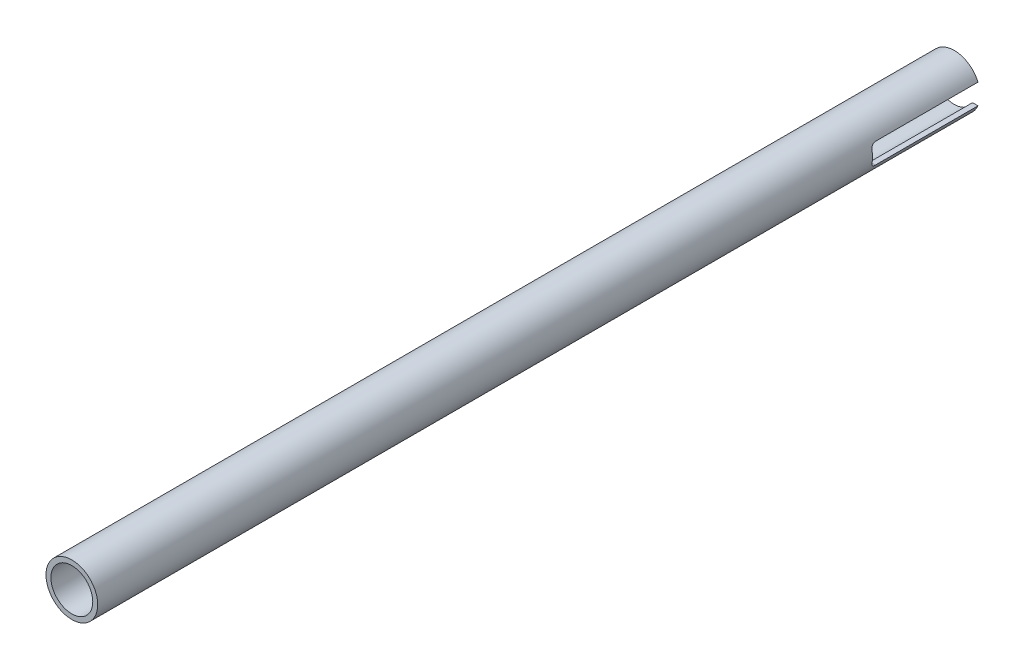
ISO-10303-21;
HEADER;
FILE_DESCRIPTION(('STEP AP214'),'2;1');
FILE_NAME('part.step','',(''),(''),'','','');
FILE_SCHEMA(('AUTOMOTIVE_DESIGN { 1 0 10303 214 1 1 1 1 }'));
ENDSEC;
DATA;
#1=APPLICATION_CONTEXT('core data for automotive mechanical design processes');
#2=APPLICATION_PROTOCOL_DEFINITION('international standard','automotive_design',2000,#1);
#3=PRODUCT_CONTEXT('',#1,'mechanical');
#4=PRODUCT('Part','Part','',(#3));
#5=PRODUCT_RELATED_PRODUCT_CATEGORY('part','',(#4));
#6=PRODUCT_DEFINITION_FORMATION('','',#4);
#7=PRODUCT_DEFINITION_CONTEXT('part definition',#1,'design');
#8=PRODUCT_DEFINITION('design','',#6,#7);
#9=PRODUCT_DEFINITION_SHAPE('','',#8);
#10=(LENGTH_UNIT() NAMED_UNIT(*) SI_UNIT(.MILLI.,.METRE.));
#11=(NAMED_UNIT(*) PLANE_ANGLE_UNIT() SI_UNIT($,.RADIAN.));
#12=(NAMED_UNIT(*) SI_UNIT($,.STERADIAN.) SOLID_ANGLE_UNIT());
#13=UNCERTAINTY_MEASURE_WITH_UNIT(LENGTH_MEASURE(1.E-05),#10,'distance_accuracy_value','');
#14=(GEOMETRIC_REPRESENTATION_CONTEXT(3) GLOBAL_UNCERTAINTY_ASSIGNED_CONTEXT((#13)) GLOBAL_UNIT_ASSIGNED_CONTEXT((#10,
#11,#12)) REPRESENTATION_CONTEXT('',''));
#15=CARTESIAN_POINT('',(0.,0.,0.));
#16=DIRECTION('',(0.,0.,1.));
#17=DIRECTION('',(1.,0.,0.));
#18=AXIS2_PLACEMENT_3D('',#15,#16,#17);
#19=CARTESIAN_POINT('',(0.,0.,0.));
#20=DIRECTION('',(0.,0.,1.));
#21=DIRECTION('',(1.,0.,0.));
#22=AXIS2_PLACEMENT_3D('',#19,#20,#21);
#23=PLANE('',#22);
#24=DIRECTION('',(-1.,0.,0.));
#25=VECTOR('',#24,1.);
#26=CARTESIAN_POINT('',(352.483983387758,-3.17500000000001,0.));
#27=LINE('',#26,#25);
#28=CARTESIAN_POINT('',(7.34407080575888,-3.17500000000001,0.));
#29=VERTEX_POINT('',#28);
#30=CARTESIAN_POINT('',(5.64543213580679,-3.17499999999999,0.));
#31=VERTEX_POINT('',#30);
#32=EDGE_CURVE('E66',#29,#31,#27,.T.);
#33=ORIENTED_EDGE('',*,*,#32,.F.);
#34=CARTESIAN_POINT('',(0.,0.,0.));
#35=DIRECTION('',(0.,0.,1.));
#36=DIRECTION('',(1.,0.,0.));
#37=AXIS2_PLACEMENT_3D('',#34,#35,#36);
#38=CIRCLE('',#37,8.001);
#39=CARTESIAN_POINT('',(-7.34407080575888,-3.17500000000001,0.));
#40=VERTEX_POINT('',#39);
#41=EDGE_CURVE('E157',#40,#29,#38,.T.);
#42=ORIENTED_EDGE('',*,*,#41,.F.);
#43=CARTESIAN_POINT('',(-5.64543213580682,-3.17500000000001,0.));
#44=VERTEX_POINT('',#43);
#45=EDGE_CURVE('E151',#44,#40,#27,.T.);
#46=ORIENTED_EDGE('',*,*,#45,.F.);
#47=CARTESIAN_POINT('',(0.,0.,0.));
#48=DIRECTION('',(0.,0.,1.));
#49=DIRECTION('',(1.,0.,0.));
#50=AXIS2_PLACEMENT_3D('',#47,#48,#49);
#51=CIRCLE('',#50,6.477);
#52=EDGE_CURVE('E262',#44,#31,#51,.T.);
#53=ORIENTED_EDGE('',*,*,#52,.T.);
#54=EDGE_LOOP('',(#33,#42,#46,#53));
#55=FACE_BOUND('',#54,.T.);
#56=ADVANCED_FACE('F41',(#55),#23,.F.);
#57=CARTESIAN_POINT('',(0.,0.,273.05));
#58=DIRECTION('',(0.,0.,-1.));
#59=DIRECTION('',(-1.,0.,0.));
#60=AXIS2_PLACEMENT_3D('',#57,#58,#59);
#61=CYLINDRICAL_SURFACE('',#60,8.001);
#62=CARTESIAN_POINT('',(0.,0.,273.05));
#63=DIRECTION('',(0.,0.,1.));
#64=DIRECTION('',(1.,0.,0.));
#65=AXIS2_PLACEMENT_3D('',#62,#63,#64);
#66=CIRCLE('',#65,8.001);
#67=CARTESIAN_POINT('',(8.001,0.,273.05));
#68=VERTEX_POINT('',#67);
#69=EDGE_CURVE('E271',#68,#68,#66,.T.);
#70=ORIENTED_EDGE('',*,*,#69,.F.);
#71=EDGE_LOOP('',(#70));
#72=FACE_BOUND('',#71,.T.);
#73=DIRECTION('',(0.,0.,-1.));
#74=VECTOR('',#73,1.);
#75=CARTESIAN_POINT('',(7.34407080575892,3.17499999999992,273.05));
#76=LINE('',#75,#74);
#77=CARTESIAN_POINT('',(7.34407080575894,3.175,0.));
#78=VERTEX_POINT('',#77);
#79=CARTESIAN_POINT('',(7.34407080575889,3.17499999999999,31.75));
#80=VERTEX_POINT('',#79);
#81=EDGE_CURVE('E256',#78,#80,#76,.F.);
#82=ORIENTED_EDGE('',*,*,#81,.F.);
#83=CARTESIAN_POINT('',(-7.34407080575894,3.175,0.));
#84=VERTEX_POINT('',#83);
#85=EDGE_CURVE('E276',#78,#84,#38,.T.);
#86=ORIENTED_EDGE('',*,*,#85,.T.);
#87=DIRECTION('',(0.,0.,-1.));
#88=VECTOR('',#87,1.);
#89=CARTESIAN_POINT('',(-7.34407080575892,3.17499999999992,273.05));
#90=LINE('',#89,#88);
#91=CARTESIAN_POINT('',(-7.34407080575889,3.17499999999999,31.75));
#92=VERTEX_POINT('',#91);
#93=EDGE_CURVE('E259',#92,#84,#90,.T.);
#94=ORIENTED_EDGE('',*,*,#93,.F.);
#95=CARTESIAN_POINT('',(-7.8288057837706,1.65099999999999,33.274));
#96=CARTESIAN_POINT('',(-7.81947795268345,1.69524181564514,33.2739996807889));
#97=CARTESIAN_POINT('',(-7.80977555287386,1.73937906238703,33.2720725755956));
#98=CARTESIAN_POINT('',(-7.7897053190962,1.82715995012294,33.2644259194222));
#99=CARTESIAN_POINT('',(-7.77933765259943,1.870803712116,33.2587073195399));
#100=CARTESIAN_POINT('',(-7.74740781787862,2.00038689143379,33.2359920832168));
#101=CARTESIAN_POINT('',(-7.72497172734663,2.08520038066885,33.2134353611242));
#102=CARTESIAN_POINT('',(-7.67879255624773,2.24931803273243,33.1543529357356));
#103=CARTESIAN_POINT('',(-7.65505009243317,2.32862475603218,33.117833776622));
#104=CARTESIAN_POINT('',(-7.60739952527334,2.47987144136614,33.0318403935313));
#105=CARTESIAN_POINT('',(-7.58349136309819,2.55180862700726,32.9823613118312));
#106=CARTESIAN_POINT('',(-7.53640113822511,2.68773877112478,32.8705553900397));
#107=CARTESIAN_POINT('',(-7.51324222932276,2.75155008701076,32.8079974672164));
#108=CARTESIAN_POINT('',(-7.46969556535498,2.86766507697724,32.6721080561482));
#109=CARTESIAN_POINT('',(-7.44930787514765,2.91996848174228,32.5987763158346));
#110=CARTESIAN_POINT('',(-7.41339882631975,3.00995182097469,32.445356056821));
#111=CARTESIAN_POINT('',(-7.39775949227146,3.04799299625043,32.365507568052));
#112=CARTESIAN_POINT('',(-7.37198636942666,3.10981595853761,32.1996963126839));
#113=CARTESIAN_POINT('',(-7.36184321814924,3.13362200161646,32.1137442276388));
#114=CARTESIAN_POINT('',(-7.35134082404798,3.15814271182933,31.980748149592));
#115=CARTESIAN_POINT('',(-7.34862226710174,3.16445643648463,31.9348527548858));
#116=CARTESIAN_POINT('',(-7.34498545577234,3.17288497032065,31.8426477775769));
#117=CARTESIAN_POINT('',(-7.34406565426136,3.17500338794749,31.7963385853611));
#118=CARTESIAN_POINT('',(-7.34407080575889,3.17499999999999,31.75));
#119=B_SPLINE_CURVE_WITH_KNOTS('',3,(#95,#96,#97,#98,#99,#100,#101,#102,#103,#104,#105,#106,
#107,#108,#109,#110,#111,#112,#113,#114,#115,#116,#117,#118),.UNSPECIFIED.,.F.,.F.,(4,2,2,2,2,2,
2,2,2,2,2,4),(0.,0.135553024626245,0.271072058592375,0.541437670457962,0.811676717226676,
1.08201720207601,1.35761362878683,1.63321650449497,1.90127196271359,2.16886935439238,
2.3078905012207,2.44679202186551),.UNSPECIFIED.);
#120=CARTESIAN_POINT('',(-7.8288057837706,1.65099999999999,33.274));
#121=VERTEX_POINT('',#120);
#122=EDGE_CURVE('E242',#121,#92,#119,.T.);
#123=ORIENTED_EDGE('',*,*,#122,.F.);
#124=CARTESIAN_POINT('',(0.,0.,33.274));
#125=DIRECTION('',(0.,0.,-1.));
#126=DIRECTION('',(-1.,0.,0.));
#127=AXIS2_PLACEMENT_3D('',#124,#125,#126);
#128=CIRCLE('',#127,8.001);
#129=CARTESIAN_POINT('',(-7.8288057837706,-1.65100000000001,33.274));
#130=VERTEX_POINT('',#129);
#131=EDGE_CURVE('E144',#130,#121,#128,.T.);
#132=ORIENTED_EDGE('',*,*,#131,.F.);
#133=CARTESIAN_POINT('',(-7.34407080575888,-3.175,31.75));
#134=CARTESIAN_POINT('',(-7.3440680096913,-3.17500157818638,31.7906984476088));
#135=CARTESIAN_POINT('',(-7.34477630214677,-3.17336860893187,31.8313759502433));
#136=CARTESIAN_POINT('',(-7.34758309143993,-3.16686635956913,31.912411407968));
#137=CARTESIAN_POINT('',(-7.34968118035477,-3.16199802907896,31.9527694533067));
#138=CARTESIAN_POINT('',(-7.35798857580184,-3.14264423927033,32.0726338560667));
#139=CARTESIAN_POINT('',(-7.36621159330718,-3.12340930879257,32.1512906881812));
#140=CARTESIAN_POINT('',(-7.38735918413182,-3.07305366060584,32.3038993996992));
#141=CARTESIAN_POINT('',(-7.40028060607282,-3.04194090905529,32.377854393813));
#142=CARTESIAN_POINT('',(-7.4298815779994,-2.96890708335138,32.5194453435949));
#143=CARTESIAN_POINT('',(-7.44656372650464,-2.92697853298673,32.5870768840646));
#144=CARTESIAN_POINT('',(-7.48338951433548,-2.83153727514408,32.7173193992745));
#145=CARTESIAN_POINT('',(-7.5036517696014,-2.77760154335605,32.7795861247467));
#146=CARTESIAN_POINT('',(-7.54586923311684,-2.66077336101833,32.8943978381578));
#147=CARTESIAN_POINT('',(-7.56782510086072,-2.59787741319581,32.9469390116058));
#148=CARTESIAN_POINT('',(-7.61377353576087,-2.46009532987571,33.04442490565));
#149=CARTESIAN_POINT('',(-7.63780327629239,-2.38468542927396,33.088613263246));
#150=CARTESIAN_POINT('',(-7.68517828309943,-2.22728162943213,33.1635295949975));
#151=CARTESIAN_POINT('',(-7.70852388215322,-2.14529100625114,33.1942642181981));
#152=CARTESIAN_POINT('',(-7.74866065435345,-1.99473307846589,33.2363269168587));
#153=CARTESIAN_POINT('',(-7.76579152458538,-1.9270088220366,33.2503889784846));
#154=CARTESIAN_POINT('',(-7.79853598216448,-1.78994063052703,33.2692336722557));
#155=CARTESIAN_POINT('',(-7.81414985826825,-1.7205970068191,33.2740180736839));
#156=CARTESIAN_POINT('',(-7.8288057837706,-1.65100000000001,33.274));
#157=B_SPLINE_CURVE_WITH_KNOTS('',3,(#133,#134,#135,#136,#137,#138,#139,#140,#141,#142,#143,
#144,#145,#146,#147,#148,#149,#150,#151,#152,#153,#154,#155,#156),.UNSPECIFIED.,.F.,.F.,(4,2,2,
2,2,2,2,2,2,2,2,4),(0.,0.122015614312961,0.243995431359561,0.486888996424005,0.729619944201783,
0.972519126749106,1.22593711832599,1.47945429417213,1.75015649231413,2.02072475374974,
2.23388433321154,2.44700325838136),.UNSPECIFIED.);
#158=CARTESIAN_POINT('',(-7.34407080575888,-3.175,31.75));
#159=VERTEX_POINT('',#158);
#160=EDGE_CURVE('E145',#159,#130,#157,.T.);
#161=ORIENTED_EDGE('',*,*,#160,.F.);
#162=DIRECTION('',(0.,0.,-1.));
#163=VECTOR('',#162,1.);
#164=CARTESIAN_POINT('',(-7.34407080575889,-3.17499999999999,273.05));
#165=LINE('',#164,#163);
#166=EDGE_CURVE('E159',#40,#159,#165,.F.);
#167=ORIENTED_EDGE('',*,*,#166,.F.);
#168=ORIENTED_EDGE('',*,*,#41,.T.);
#169=DIRECTION('',(0.,0.,-1.));
#170=VECTOR('',#169,1.);
#171=CARTESIAN_POINT('',(7.34407080575889,-3.17499999999999,273.05));
#172=LINE('',#171,#170);
#173=CARTESIAN_POINT('',(7.34407080575888,-3.175,31.75));
#174=VERTEX_POINT('',#173);
#175=EDGE_CURVE('E148',#174,#29,#172,.T.);
#176=ORIENTED_EDGE('',*,*,#175,.F.);
#177=CARTESIAN_POINT('',(7.8288057837706,-1.65100000000001,33.274));
#178=CARTESIAN_POINT('',(7.81947795268344,-1.69524181564516,33.2739996807889));
#179=CARTESIAN_POINT('',(7.80977555287386,-1.73937906238705,33.2720725755956));
#180=CARTESIAN_POINT('',(7.78970531909619,-1.82715995012295,33.2644259194222));
#181=CARTESIAN_POINT('',(7.77933765259943,-1.87080371211602,33.2587073195399));
#182=CARTESIAN_POINT('',(7.74740781787862,-2.00038689143381,33.2359920832168));
#183=CARTESIAN_POINT('',(7.72497172734662,-2.08520038066886,33.2134353611242));
#184=CARTESIAN_POINT('',(7.67879255624773,-2.24931803273245,33.1543529357356));
#185=CARTESIAN_POINT('',(7.65505009243317,-2.3286247560322,33.117833776622));
#186=CARTESIAN_POINT('',(7.60739952527334,-2.47987144136616,33.0318403935313));
#187=CARTESIAN_POINT('',(7.58349136309819,-2.55180862700728,32.9823613118312));
#188=CARTESIAN_POINT('',(7.5364011382251,-2.6877387711248,32.8705553900397));
#189=CARTESIAN_POINT('',(7.51324222932275,-2.75155008701078,32.8079974672164));
#190=CARTESIAN_POINT('',(7.46969556535497,-2.86766507697726,32.6721080561482));
#191=CARTESIAN_POINT('',(7.44930787514765,-2.9199684817423,32.5987763158346));
#192=CARTESIAN_POINT('',(7.41339882631974,-3.00995182097471,32.445356056821));
#193=CARTESIAN_POINT('',(7.39775949227145,-3.04799299625045,32.365507568052));
#194=CARTESIAN_POINT('',(7.37198636942665,-3.10981595853762,32.1996963126839));
#195=CARTESIAN_POINT('',(7.36184321814923,-3.13362200161647,32.1137442276388));
#196=CARTESIAN_POINT('',(7.35134082404797,-3.15814271182935,31.980748149592));
#197=CARTESIAN_POINT('',(7.34862226710173,-3.16445643648464,31.9348527548858));
#198=CARTESIAN_POINT('',(7.34498545577233,-3.17288497032067,31.8426477775769));
#199=CARTESIAN_POINT('',(7.34406565426135,-3.17500338794751,31.7963385853611));
#200=CARTESIAN_POINT('',(7.34407080575888,-3.175,31.75));
#201=B_SPLINE_CURVE_WITH_KNOTS('',3,(#177,#178,#179,#180,#181,#182,#183,#184,#185,#186,#187,
#188,#189,#190,#191,#192,#193,#194,#195,#196,#197,#198,#199,#200),.UNSPECIFIED.,.F.,.F.,(4,2,2,
2,2,2,2,2,2,2,2,4),(0.,0.135553024626244,0.271072058592371,0.541437670457961,0.811676717226673,
1.082017202076,1.35761362878683,1.63321650449497,1.90127196271358,2.16886935439238,
2.3078905012207,2.4467920218655),.UNSPECIFIED.);
#202=CARTESIAN_POINT('',(7.8288057837706,-1.65100000000001,33.274));
#203=VERTEX_POINT('',#202);
#204=EDGE_CURVE('E133',#203,#174,#201,.T.);
#205=ORIENTED_EDGE('',*,*,#204,.F.);
#206=CARTESIAN_POINT('',(7.8288057837706,1.65099999999999,33.274));
#207=VERTEX_POINT('',#206);
#208=EDGE_CURVE('E249',#207,#203,#128,.T.);
#209=ORIENTED_EDGE('',*,*,#208,.F.);
#210=CARTESIAN_POINT('',(7.34407080575889,3.17499999999999,31.75));
#211=CARTESIAN_POINT('',(7.34406800969131,3.17500157818637,31.7906984476088));
#212=CARTESIAN_POINT('',(7.34477630214678,3.17336860893185,31.8313759502433));
#213=CARTESIAN_POINT('',(7.34758309143993,3.16686635956911,31.912411407968));
#214=CARTESIAN_POINT('',(7.34968118035478,3.16199802907894,31.9527694533067));
#215=CARTESIAN_POINT('',(7.35798857580184,3.14264423927031,32.0726338560667));
#216=CARTESIAN_POINT('',(7.36621159330719,3.12340930879255,32.1512906881812));
#217=CARTESIAN_POINT('',(7.38735918413183,3.07305366060582,32.3038993996992));
#218=CARTESIAN_POINT('',(7.40028060607282,3.04194090905527,32.377854393813));
#219=CARTESIAN_POINT('',(7.42988157799941,2.96890708335136,32.5194453435949));
#220=CARTESIAN_POINT('',(7.44656372650465,2.92697853298671,32.5870768840646));
#221=CARTESIAN_POINT('',(7.48338951433549,2.83153727514406,32.7173193992745));
#222=CARTESIAN_POINT('',(7.50365176960141,2.77760154335604,32.7795861247467));
#223=CARTESIAN_POINT('',(7.54586923311685,2.66077336101832,32.8943978381578));
#224=CARTESIAN_POINT('',(7.56782510086072,2.59787741319579,32.9469390116058));
#225=CARTESIAN_POINT('',(7.61377353576087,2.4600953298757,33.04442490565));
#226=CARTESIAN_POINT('',(7.6378032762924,2.38468542927394,33.088613263246));
#227=CARTESIAN_POINT('',(7.68517828309944,2.22728162943211,33.1635295949975));
#228=CARTESIAN_POINT('',(7.70852388215323,2.14529100625112,33.1942642181981));
#229=CARTESIAN_POINT('',(7.74866065435345,1.99473307846586,33.2363269168587));
#230=CARTESIAN_POINT('',(7.76579152458538,1.92700882203658,33.2503889784846));
#231=CARTESIAN_POINT('',(7.79853598216448,1.78994063052701,33.2692336722557));
#232=CARTESIAN_POINT('',(7.81414985826825,1.72059700681908,33.2740180736839));
#233=CARTESIAN_POINT('',(7.8288057837706,1.65099999999999,33.274));
#234=B_SPLINE_CURVE_WITH_KNOTS('',3,(#210,#211,#212,#213,#214,#215,#216,#217,#218,#219,#220,
#221,#222,#223,#224,#225,#226,#227,#228,#229,#230,#231,#232,#233),.UNSPECIFIED.,.F.,.F.,(4,2,2,
2,2,2,2,2,2,2,2,4),(0.,0.122015614312961,0.243995431359561,0.486888996424005,0.729619944201783,
0.972519126749114,1.22593711832599,1.47945429417213,1.75015649231414,2.02072475374975,
2.23388433321155,2.44700325838137),.UNSPECIFIED.);
#235=EDGE_CURVE('E248',#80,#207,#234,.T.);
#236=ORIENTED_EDGE('',*,*,#235,.F.);
#237=EDGE_LOOP('',(#82,#86,#94,#123,#132,#161,#167,#168,#176,#205,#209,#236));
#238=FACE_BOUND('',#237,.T.);
#239=ADVANCED_FACE('F43',(#72,#238),#61,.T.);
#240=CARTESIAN_POINT('',(0.,0.,273.05));
#241=DIRECTION('',(0.,0.,-1.));
#242=DIRECTION('',(-1.,0.,0.));
#243=AXIS2_PLACEMENT_3D('',#240,#241,#242);
#244=CYLINDRICAL_SURFACE('',#243,6.477);
#245=CARTESIAN_POINT('',(0.,0.,273.05));
#246=DIRECTION('',(0.,0.,1.));
#247=DIRECTION('',(1.,0.,0.));
#248=AXIS2_PLACEMENT_3D('',#245,#246,#247);
#249=CIRCLE('',#248,6.477);
#250=CARTESIAN_POINT('',(6.477,0.,273.05));
#251=VERTEX_POINT('',#250);
#252=EDGE_CURVE('E263',#251,#251,#249,.T.);
#253=ORIENTED_EDGE('',*,*,#252,.T.);
#254=EDGE_LOOP('',(#253));
#255=FACE_BOUND('',#254,.T.);
#256=CARTESIAN_POINT('',(5.64543213580682,3.175,0.));
#257=VERTEX_POINT('',#256);
#258=CARTESIAN_POINT('',(-5.64543213580682,3.175,0.));
#259=VERTEX_POINT('',#258);
#260=EDGE_CURVE('E267',#257,#259,#51,.T.);
#261=ORIENTED_EDGE('',*,*,#260,.F.);
#262=DIRECTION('',(0.,0.,-1.));
#263=VECTOR('',#262,1.);
#264=CARTESIAN_POINT('',(5.64543213580683,3.17499999999992,273.05));
#265=LINE('',#264,#263);
#266=CARTESIAN_POINT('',(5.64543213580679,3.17499999999999,31.75));
#267=VERTEX_POINT('',#266);
#268=EDGE_CURVE('E12',#257,#267,#265,.F.);
#269=ORIENTED_EDGE('',*,*,#268,.T.);
#270=CARTESIAN_POINT('',(5.6454321358068,3.17499999999999,31.75));
#271=CARTESIAN_POINT('',(5.64542798532432,3.1750025301249,31.7895022750384));
#272=CARTESIAN_POINT('',(5.64629676751123,3.17346305780188,31.8289831851797));
#273=CARTESIAN_POINT('',(5.64973489172762,3.16734010596933,31.907616333837));
#274=CARTESIAN_POINT('',(5.65230347216193,3.16275798971433,31.9467687115998));
#275=CARTESIAN_POINT('',(5.66245282356231,3.14457608288718,32.0629070155873));
#276=CARTESIAN_POINT('',(5.67247830845162,3.1265396508718,32.1390381879893));
#277=CARTESIAN_POINT('',(5.69814957474155,3.07950075965754,32.2866255007952));
#278=CARTESIAN_POINT('',(5.71378770060105,3.05051323473277,32.3580878532046));
#279=CARTESIAN_POINT('',(5.74949312759986,2.98267072120713,32.4950337996201));
#280=CARTESIAN_POINT('',(5.7695654342793,2.94380457356395,32.5605105176722));
#281=CARTESIAN_POINT('',(5.81427344287328,2.85454020484128,32.6883725064171));
#282=CARTESIAN_POINT('',(5.83912294015509,2.80355001313473,32.7502682413202));
#283=CARTESIAN_POINT('',(5.89090094280743,2.69305400468479,32.8649190340714));
#284=CARTESIAN_POINT('',(5.91783040535228,2.63354425646504,32.9176698468731));
#285=CARTESIAN_POINT('',(5.9754026920417,2.50037980782341,33.0183991647787));
#286=CARTESIAN_POINT('',(6.00613015030678,2.42589024924425,33.0652294493506));
#287=CARTESIAN_POINT('',(6.06685054178971,2.26977298542591,33.1454912659983));
#288=CARTESIAN_POINT('',(6.09684379767184,2.18814849062352,33.1789287868608));
#289=CARTESIAN_POINT('',(6.15068954263711,2.0313545212819,33.2277262918858));
#290=CARTESIAN_POINT('',(6.17481721444706,1.95685658409067,33.2449485076857));
#291=CARTESIAN_POINT('',(6.2208090046563,1.80539896583251,33.2681012531514));
#292=CARTESIAN_POINT('',(6.24267154884635,1.72843762073706,33.2740239790673));
#293=CARTESIAN_POINT('',(6.26304462701648,1.65099999999999,33.274));
#294=B_SPLINE_CURVE_WITH_KNOTS('',3,(#270,#271,#272,#273,#274,#275,#276,#277,#278,#279,#280,
#281,#282,#283,#284,#285,#286,#287,#288,#289,#290,#291,#292,#293),.UNSPECIFIED.,.F.,.F.,(4,2,2,
2,2,2,2,2,2,2,2,4),(0.,0.118426117882553,0.236799210795268,0.472172634307253,0.707226225252078,
0.942546525606806,1.19340365391803,1.44437691938388,1.72272641785956,2.0009513086068,
2.2406452178067,2.48050460661625),.UNSPECIFIED.);
#295=CARTESIAN_POINT('',(6.26304462701648,1.65099999999999,33.274));
#296=VERTEX_POINT('',#295);
#297=EDGE_CURVE('E51',#267,#296,#294,.T.);
#298=ORIENTED_EDGE('',*,*,#297,.T.);
#299=CARTESIAN_POINT('',(0.,0.,33.274));
#300=DIRECTION('',(0.,0.,-1.));
#301=DIRECTION('',(-1.,0.,0.));
#302=AXIS2_PLACEMENT_3D('',#299,#300,#301);
#303=CIRCLE('',#302,6.477);
#304=CARTESIAN_POINT('',(6.26304462701648,-1.65100000000001,33.274));
#305=VERTEX_POINT('',#304);
#306=EDGE_CURVE('E204',#296,#305,#303,.T.);
#307=ORIENTED_EDGE('',*,*,#306,.T.);
#308=CARTESIAN_POINT('',(6.26304462701648,-1.65100000000001,33.274));
#309=CARTESIAN_POINT('',(6.25119301356599,-1.69597019045452,33.2739996512926));
#310=CARTESIAN_POINT('',(6.23885805015263,-1.74078424361484,33.2720087653986));
#311=CARTESIAN_POINT('',(6.21333080831812,-1.82980515275706,33.264134138941));
#312=CARTESIAN_POINT('',(6.20013884930389,-1.87401222760585,33.2582518413062));
#313=CARTESIAN_POINT('',(6.15951133396886,-2.00506101361784,33.2349457970163));
#314=CARTESIAN_POINT('',(6.13094979172369,-2.09061085165535,33.2118617467996));
#315=CARTESIAN_POINT('',(6.07212151471613,-2.25578612168244,33.1516219603263));
#316=CARTESIAN_POINT('',(6.04185654214358,-2.33541748531392,33.1144805465843));
#317=CARTESIAN_POINT('',(5.98100165398782,-2.48713337520254,33.0271532445204));
#318=CARTESIAN_POINT('',(5.95041151302896,-2.55921223237762,32.9769576544588));
#319=CARTESIAN_POINT('',(5.88959770370069,-2.69629003214929,32.8627307014112));
#320=CARTESIAN_POINT('',(5.85942026108732,-2.76097278644595,32.7982938275107));
#321=CARTESIAN_POINT('',(5.80262181829034,-2.87843237174363,32.6579375307773));
#322=CARTESIAN_POINT('',(5.77600068690932,-2.93120964200445,32.5820185317567));
#323=CARTESIAN_POINT('',(5.72961508062245,-3.02084256755071,32.4238173863488));
#324=CARTESIAN_POINT('',(5.70961192114585,-3.05826802843451,32.3419300118511));
#325=CARTESIAN_POINT('',(5.67705818777086,-3.11828924116529,32.1715909438744));
#326=CARTESIAN_POINT('',(5.66448853762436,-3.14092296814996,32.0831567140417));
#327=CARTESIAN_POINT('',(5.65274801817815,-3.16196375608022,31.953042864781));
#328=CARTESIAN_POINT('',(5.65001234622036,-3.16684526064363,31.9126313476031));
#329=CARTESIAN_POINT('',(5.64635324825543,-3.17336296637714,31.8314890576694));
#330=CARTESIAN_POINT('',(5.64542881846813,-3.17500096508517,31.790758474312));
#331=CARTESIAN_POINT('',(5.64543213580679,-3.175,31.75));
#332=B_SPLINE_CURVE_WITH_KNOTS('',3,(#308,#309,#310,#311,#312,#313,#314,#315,#316,#317,#318,
#319,#320,#321,#322,#323,#324,#325,#326,#327,#328,#329,#330,#331),.UNSPECIFIED.,.F.,.F.,(4,2,2,
2,2,2,2,2,2,2,2,4),(0.,0.139419976741779,0.278788285754547,0.556665652257203,0.834260658887697,
1.11206256399923,1.3991269523371,1.6861807475333,1.9613229485987,2.23575596690122,
2.35800176569004,2.48017979736539),.UNSPECIFIED.);
#333=CARTESIAN_POINT('',(5.64543213580682,-3.175,31.75));
#334=VERTEX_POINT('',#333);
#335=EDGE_CURVE('E197',#305,#334,#332,.T.);
#336=ORIENTED_EDGE('',*,*,#335,.T.);
#337=DIRECTION('',(0.,0.,-1.));
#338=VECTOR('',#337,1.);
#339=CARTESIAN_POINT('',(5.64543213580679,-3.17499999999999,273.05));
#340=LINE('',#339,#338);
#341=EDGE_CURVE('E149',#334,#31,#340,.T.);
#342=ORIENTED_EDGE('',*,*,#341,.T.);
#343=ORIENTED_EDGE('',*,*,#52,.F.);
#344=DIRECTION('',(0.,0.,-1.));
#345=VECTOR('',#344,1.);
#346=CARTESIAN_POINT('',(-5.64543213580679,-3.17499999999999,273.05));
#347=LINE('',#346,#345);
#348=CARTESIAN_POINT('',(-5.64543213580679,-3.17499999999999,31.75));
#349=VERTEX_POINT('',#348);
#350=EDGE_CURVE('E275',#44,#349,#347,.F.);
#351=ORIENTED_EDGE('',*,*,#350,.T.);
#352=CARTESIAN_POINT('',(-5.64543213580679,-3.175,31.75));
#353=CARTESIAN_POINT('',(-5.64542798532432,-3.17500253012492,31.7895022750384));
#354=CARTESIAN_POINT('',(-5.64629676751122,-3.17346305780189,31.8289831851797));
#355=CARTESIAN_POINT('',(-5.64973489172761,-3.16734010596935,31.907616333837));
#356=CARTESIAN_POINT('',(-5.65230347216192,-3.16275798971435,31.9467687115998));
#357=CARTESIAN_POINT('',(-5.6624528235623,-3.1445760828872,32.0629070155873));
#358=CARTESIAN_POINT('',(-5.67247830845161,-3.12653965087182,32.1390381879893));
#359=CARTESIAN_POINT('',(-5.69814957474154,-3.07950075965756,32.2866255007952));
#360=CARTESIAN_POINT('',(-5.71378770060104,-3.05051323473279,32.3580878532046));
#361=CARTESIAN_POINT('',(-5.74949312759985,-2.98267072120715,32.4950337996201));
#362=CARTESIAN_POINT('',(-5.76956543427929,-2.94380457356397,32.5605105176722));
#363=CARTESIAN_POINT('',(-5.81427344287327,-2.85454020484131,32.6883725064171));
#364=CARTESIAN_POINT('',(-5.83912294015508,-2.80355001313475,32.7502682413202));
#365=CARTESIAN_POINT('',(-5.89090094280742,-2.69305400468481,32.8649190340714));
#366=CARTESIAN_POINT('',(-5.91783040535227,-2.63354425646506,32.9176698468731));
#367=CARTESIAN_POINT('',(-5.97540269204169,-2.50037980782343,33.0183991647787));
#368=CARTESIAN_POINT('',(-6.00613015030677,-2.42589024924428,33.0652294493506));
#369=CARTESIAN_POINT('',(-6.0668505417897,-2.26977298542594,33.1454912659983));
#370=CARTESIAN_POINT('',(-6.09684379767183,-2.18814849062355,33.1789287868608));
#371=CARTESIAN_POINT('',(-6.1506895426371,-2.03135452128193,33.2277262918858));
#372=CARTESIAN_POINT('',(-6.17481721444705,-1.9568565840907,33.2449485076857));
#373=CARTESIAN_POINT('',(-6.22080900465629,-1.80539896583254,33.2681012531514));
#374=CARTESIAN_POINT('',(-6.24267154884634,-1.72843762073708,33.2740239790673));
#375=CARTESIAN_POINT('',(-6.26304462701648,-1.65100000000001,33.274));
#376=B_SPLINE_CURVE_WITH_KNOTS('',3,(#352,#353,#354,#355,#356,#357,#358,#359,#360,#361,#362,
#363,#364,#365,#366,#367,#368,#369,#370,#371,#372,#373,#374,#375),.UNSPECIFIED.,.F.,.F.,(4,2,2,
2,2,2,2,2,2,2,2,4),(0.,0.118426117882546,0.236799210795261,0.472172634307245,0.707226225252078,
0.942546525606797,1.19340365391802,1.44437691938387,1.72272641785954,2.00095130860679,
2.24064521780669,2.48050460661625),.UNSPECIFIED.);
#377=CARTESIAN_POINT('',(-6.26304462701648,-1.65100000000001,33.274));
#378=VERTEX_POINT('',#377);
#379=EDGE_CURVE('E187',#349,#378,#376,.T.);
#380=ORIENTED_EDGE('',*,*,#379,.T.);
#381=CARTESIAN_POINT('',(-6.26304462701648,1.65099999999999,33.274));
#382=VERTEX_POINT('',#381);
#383=EDGE_CURVE('E230',#378,#382,#303,.T.);
#384=ORIENTED_EDGE('',*,*,#383,.T.);
#385=CARTESIAN_POINT('',(-6.26304462701648,1.65099999999999,33.274));
#386=CARTESIAN_POINT('',(-6.25119301356599,1.6959701904545,33.2739996512926));
#387=CARTESIAN_POINT('',(-6.23885805015264,1.74078424361482,33.2720087653986));
#388=CARTESIAN_POINT('',(-6.21333080831813,1.82980515275704,33.264134138941));
#389=CARTESIAN_POINT('',(-6.20013884930389,1.87401222760583,33.2582518413062));
#390=CARTESIAN_POINT('',(-6.15951133396887,2.00506101361782,33.2349457970163));
#391=CARTESIAN_POINT('',(-6.1309497917237,2.09061085165533,33.2118617467996));
#392=CARTESIAN_POINT('',(-6.07212151471614,2.25578612168242,33.1516219603263));
#393=CARTESIAN_POINT('',(-6.04185654214358,2.3354174853139,33.1144805465843));
#394=CARTESIAN_POINT('',(-5.98100165398783,2.48713337520252,33.0271532445204));
#395=CARTESIAN_POINT('',(-5.95041151302897,2.5592122323776,32.9769576544588));
#396=CARTESIAN_POINT('',(-5.8895977037007,2.69629003214927,32.8627307014112));
#397=CARTESIAN_POINT('',(-5.85942026108733,2.76097278644594,32.7982938275107));
#398=CARTESIAN_POINT('',(-5.80262181829035,2.87843237174361,32.6579375307773));
#399=CARTESIAN_POINT('',(-5.77600068690933,2.93120964200443,32.5820185317567));
#400=CARTESIAN_POINT('',(-5.72961508062246,3.02084256755069,32.4238173863488));
#401=CARTESIAN_POINT('',(-5.70961192114586,3.0582680284345,32.3419300118511));
#402=CARTESIAN_POINT('',(-5.67705818777087,3.11828924116527,32.1715909438744));
#403=CARTESIAN_POINT('',(-5.66448853762437,3.14092296814994,32.0831567140417));
#404=CARTESIAN_POINT('',(-5.65274801817816,3.1619637560802,31.953042864781));
#405=CARTESIAN_POINT('',(-5.65001234622037,3.16684526064361,31.9126313476031));
#406=CARTESIAN_POINT('',(-5.64635324825544,3.17336296637712,31.8314890576694));
#407=CARTESIAN_POINT('',(-5.64542881846814,3.17500096508515,31.790758474312));
#408=CARTESIAN_POINT('',(-5.6454321358068,3.17499999999999,31.75));
#409=B_SPLINE_CURVE_WITH_KNOTS('',3,(#385,#386,#387,#388,#389,#390,#391,#392,#393,#394,#395,
#396,#397,#398,#399,#400,#401,#402,#403,#404,#405,#406,#407,#408),.UNSPECIFIED.,.F.,.F.,(4,2,2,
2,2,2,2,2,2,2,2,4),(0.,0.139419976741779,0.278788285754548,0.556665652257205,0.834260658887702,
1.11206256399923,1.39912695233711,1.68618074753331,1.9613229485987,2.23575596690122,
2.35800176569004,2.4801797973654),.UNSPECIFIED.);
#410=CARTESIAN_POINT('',(-5.64543213580679,3.17499999999999,31.75));
#411=VERTEX_POINT('',#410);
#412=EDGE_CURVE('E222',#382,#411,#409,.T.);
#413=ORIENTED_EDGE('',*,*,#412,.T.);
#414=DIRECTION('',(0.,0.,-1.));
#415=VECTOR('',#414,1.);
#416=CARTESIAN_POINT('',(-5.64543213580683,3.17499999999992,273.05));
#417=LINE('',#416,#415);
#418=EDGE_CURVE('E229',#411,#259,#417,.T.);
#419=ORIENTED_EDGE('',*,*,#418,.T.);
#420=EDGE_LOOP('',(#261,#269,#298,#307,#336,#342,#343,#351,#380,#384,#413,#419));
#421=FACE_BOUND('',#420,.T.);
#422=ADVANCED_FACE('F210',(#255,#421),#244,.F.);
#423=CARTESIAN_POINT('',(0.,0.,273.05));
#424=DIRECTION('',(0.,0.,1.));
#425=DIRECTION('',(1.,0.,0.));
#426=AXIS2_PLACEMENT_3D('',#423,#424,#425);
#427=PLANE('',#426);
#428=ORIENTED_EDGE('',*,*,#69,.T.);
#429=EDGE_LOOP('',(#428));
#430=FACE_BOUND('',#429,.T.);
#431=ORIENTED_EDGE('',*,*,#252,.F.);
#432=EDGE_LOOP('',(#431));
#433=FACE_BOUND('',#432,.T.);
#434=ADVANCED_FACE('F215',(#430,#433),#427,.T.);
#435=ORIENTED_EDGE('',*,*,#85,.F.);
#436=DIRECTION('',(-1.,0.,0.));
#437=VECTOR('',#436,1.);
#438=CARTESIAN_POINT('',(352.483983387758,3.175,0.));
#439=LINE('',#438,#437);
#440=EDGE_CURVE('E164',#78,#257,#439,.T.);
#441=ORIENTED_EDGE('',*,*,#440,.T.);
#442=ORIENTED_EDGE('',*,*,#260,.T.);
#443=EDGE_CURVE('E302',#259,#84,#439,.T.);
#444=ORIENTED_EDGE('',*,*,#443,.T.);
#445=EDGE_LOOP('',(#435,#441,#442,#444));
#446=FACE_BOUND('',#445,.T.);
#447=ADVANCED_FACE('F341',(#446),#23,.F.);
#448=CARTESIAN_POINT('',(352.483983387758,-3.175,31.75));
#449=DIRECTION('',(0.,1.,0.));
#450=DIRECTION('',(0.,0.,1.));
#451=AXIS2_PLACEMENT_3D('',#448,#449,#450);
#452=PLANE('',#451);
#453=ORIENTED_EDGE('',*,*,#45,.T.);
#454=ORIENTED_EDGE('',*,*,#166,.T.);
#455=DIRECTION('',(-1.,0.,0.));
#456=VECTOR('',#455,1.);
#457=CARTESIAN_POINT('',(352.483983387758,-3.175,31.75));
#458=LINE('',#457,#456);
#459=EDGE_CURVE('E58',#349,#159,#458,.T.);
#460=ORIENTED_EDGE('',*,*,#459,.F.);
#461=ORIENTED_EDGE('',*,*,#350,.F.);
#462=EDGE_LOOP('',(#453,#454,#460,#461));
#463=FACE_BOUND('',#462,.T.);
#464=ADVANCED_FACE('F354',(#463),#452,.T.);
#465=CARTESIAN_POINT('',(352.483983387758,-1.65100000000001,31.75));
#466=DIRECTION('',(-1.,0.,0.));
#467=DIRECTION('',(0.,0.,1.));
#468=AXIS2_PLACEMENT_3D('',#465,#466,#467);
#469=CYLINDRICAL_SURFACE('',#468,1.524);
#470=ORIENTED_EDGE('',*,*,#459,.T.);
#471=ORIENTED_EDGE('',*,*,#160,.T.);
#472=DIRECTION('',(-1.,0.,0.));
#473=VECTOR('',#472,1.);
#474=CARTESIAN_POINT('',(352.483983387758,-1.65100000000001,33.274));
#475=LINE('',#474,#473);
#476=EDGE_CURVE('E314',#378,#130,#475,.T.);
#477=ORIENTED_EDGE('',*,*,#476,.F.);
#478=ORIENTED_EDGE('',*,*,#379,.F.);
#479=EDGE_LOOP('',(#470,#471,#477,#478));
#480=FACE_BOUND('',#479,.T.);
#481=ADVANCED_FACE('F182',(#480),#469,.F.);
#482=CARTESIAN_POINT('',(352.483983387758,1.65099999999999,33.274));
#483=DIRECTION('',(0.,0.,-1.));
#484=DIRECTION('',(-1.,0.,0.));
#485=AXIS2_PLACEMENT_3D('',#482,#483,#484);
#486=PLANE('',#485);
#487=ORIENTED_EDGE('',*,*,#476,.T.);
#488=ORIENTED_EDGE('',*,*,#131,.T.);
#489=DIRECTION('',(-1.,0.,0.));
#490=VECTOR('',#489,1.);
#491=CARTESIAN_POINT('',(352.483983387758,1.65099999999999,33.274));
#492=LINE('',#491,#490);
#493=EDGE_CURVE('E310',#382,#121,#492,.T.);
#494=ORIENTED_EDGE('',*,*,#493,.F.);
#495=ORIENTED_EDGE('',*,*,#383,.F.);
#496=EDGE_LOOP('',(#487,#488,#494,#495));
#497=FACE_BOUND('',#496,.T.);
#498=ADVANCED_FACE('F330',(#497),#486,.T.);
#499=CARTESIAN_POINT('',(352.483983387758,1.65099999999999,31.75));
#500=DIRECTION('',(-1.,0.,0.));
#501=DIRECTION('',(0.,0.,1.));
#502=AXIS2_PLACEMENT_3D('',#499,#500,#501);
#503=CYLINDRICAL_SURFACE('',#502,1.524);
#504=ORIENTED_EDGE('',*,*,#493,.T.);
#505=ORIENTED_EDGE('',*,*,#122,.T.);
#506=DIRECTION('',(-1.,0.,0.));
#507=VECTOR('',#506,1.);
#508=CARTESIAN_POINT('',(352.483983387758,3.17499999999999,31.75));
#509=LINE('',#508,#507);
#510=EDGE_CURVE('E303',#411,#92,#509,.T.);
#511=ORIENTED_EDGE('',*,*,#510,.F.);
#512=ORIENTED_EDGE('',*,*,#412,.F.);
#513=EDGE_LOOP('',(#504,#505,#511,#512));
#514=FACE_BOUND('',#513,.T.);
#515=ADVANCED_FACE('F236',(#514),#503,.F.);
#516=CARTESIAN_POINT('',(352.483983387758,3.175,0.));
#517=DIRECTION('',(0.,-1.,0.));
#518=DIRECTION('',(0.,0.,-1.));
#519=AXIS2_PLACEMENT_3D('',#516,#517,#518);
#520=PLANE('',#519);
#521=ORIENTED_EDGE('',*,*,#510,.T.);
#522=ORIENTED_EDGE('',*,*,#93,.T.);
#523=ORIENTED_EDGE('',*,*,#443,.F.);
#524=ORIENTED_EDGE('',*,*,#418,.F.);
#525=EDGE_LOOP('',(#521,#522,#523,#524));
#526=FACE_BOUND('',#525,.T.);
#527=ADVANCED_FACE('F217',(#526),#520,.T.);
#528=ORIENTED_EDGE('',*,*,#440,.F.);
#529=ORIENTED_EDGE('',*,*,#81,.T.);
#530=EDGE_CURVE('E295',#80,#267,#509,.T.);
#531=ORIENTED_EDGE('',*,*,#530,.T.);
#532=ORIENTED_EDGE('',*,*,#268,.F.);
#533=EDGE_LOOP('',(#528,#529,#531,#532));
#534=FACE_BOUND('',#533,.T.);
#535=ADVANCED_FACE('F234',(#534),#520,.T.);
#536=ORIENTED_EDGE('',*,*,#530,.F.);
#537=ORIENTED_EDGE('',*,*,#235,.T.);
#538=EDGE_CURVE('E298',#207,#296,#492,.T.);
#539=ORIENTED_EDGE('',*,*,#538,.T.);
#540=ORIENTED_EDGE('',*,*,#297,.F.);
#541=EDGE_LOOP('',(#536,#537,#539,#540));
#542=FACE_BOUND('',#541,.T.);
#543=ADVANCED_FACE('F231',(#542),#503,.F.);
#544=ORIENTED_EDGE('',*,*,#538,.F.);
#545=ORIENTED_EDGE('',*,*,#208,.T.);
#546=EDGE_CURVE('E139',#203,#305,#475,.T.);
#547=ORIENTED_EDGE('',*,*,#546,.T.);
#548=ORIENTED_EDGE('',*,*,#306,.F.);
#549=EDGE_LOOP('',(#544,#545,#547,#548));
#550=FACE_BOUND('',#549,.T.);
#551=ADVANCED_FACE('F181',(#550),#486,.T.);
#552=ORIENTED_EDGE('',*,*,#546,.F.);
#553=ORIENTED_EDGE('',*,*,#204,.T.);
#554=EDGE_CURVE('E136',#174,#334,#458,.T.);
#555=ORIENTED_EDGE('',*,*,#554,.T.);
#556=ORIENTED_EDGE('',*,*,#335,.F.);
#557=EDGE_LOOP('',(#552,#553,#555,#556));
#558=FACE_BOUND('',#557,.T.);
#559=ADVANCED_FACE('F135',(#558),#469,.F.);
#560=ORIENTED_EDGE('',*,*,#554,.F.);
#561=ORIENTED_EDGE('',*,*,#175,.T.);
#562=ORIENTED_EDGE('',*,*,#32,.T.);
#563=ORIENTED_EDGE('',*,*,#341,.F.);
#564=EDGE_LOOP('',(#560,#561,#562,#563));
#565=FACE_BOUND('',#564,.T.);
#566=ADVANCED_FACE('F147',(#565),#452,.T.);
#567=CLOSED_SHELL('',(#56,#239,#422,#434,#447,#464,#481,#498,#515,#527,#535,#543,#551,#559,#566));
#568=MANIFOLD_SOLID_BREP('B2',#567);
#569=ADVANCED_BREP_SHAPE_REPRESENTATION('',(#18,#568),#14);
#570=SHAPE_DEFINITION_REPRESENTATION(#9,#569);
ENDSEC;
END-ISO-10303-21;
